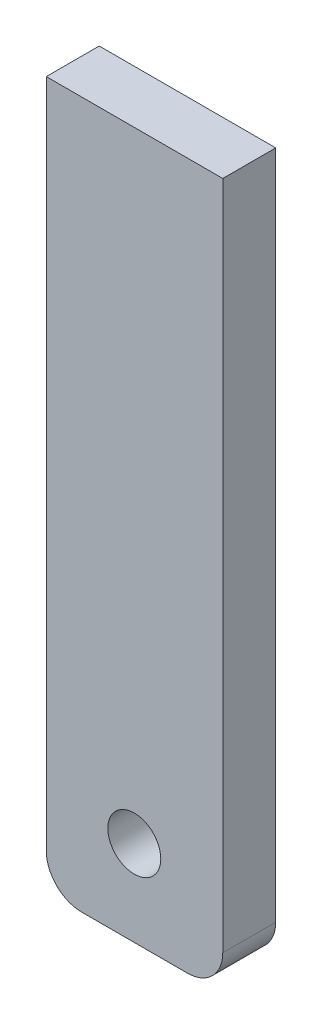
ISO-10303-21;
HEADER;
FILE_DESCRIPTION(('STEP AP214'),'2;1');
FILE_NAME('part.step','',(''),(''),'','','');
FILE_SCHEMA(('AUTOMOTIVE_DESIGN { 1 0 10303 214 1 1 1 1 }'));
ENDSEC;
DATA;
#1=APPLICATION_CONTEXT('core data for automotive mechanical design processes');
#2=APPLICATION_PROTOCOL_DEFINITION('international standard','automotive_design',2000,#1);
#3=PRODUCT_CONTEXT('',#1,'mechanical');
#4=PRODUCT('Part','Part','',(#3));
#5=PRODUCT_RELATED_PRODUCT_CATEGORY('part','',(#4));
#6=PRODUCT_DEFINITION_FORMATION('','',#4);
#7=PRODUCT_DEFINITION_CONTEXT('part definition',#1,'design');
#8=PRODUCT_DEFINITION('design','',#6,#7);
#9=PRODUCT_DEFINITION_SHAPE('','',#8);
#10=(LENGTH_UNIT() NAMED_UNIT(*) SI_UNIT(.MILLI.,.METRE.));
#11=(NAMED_UNIT(*) PLANE_ANGLE_UNIT() SI_UNIT($,.RADIAN.));
#12=(NAMED_UNIT(*) SI_UNIT($,.STERADIAN.) SOLID_ANGLE_UNIT());
#13=UNCERTAINTY_MEASURE_WITH_UNIT(LENGTH_MEASURE(1.E-05),#10,'distance_accuracy_value','');
#14=(GEOMETRIC_REPRESENTATION_CONTEXT(3) GLOBAL_UNCERTAINTY_ASSIGNED_CONTEXT((#13)) GLOBAL_UNIT_ASSIGNED_CONTEXT((#10,
#11,#12)) REPRESENTATION_CONTEXT('',''));
#15=CARTESIAN_POINT('',(0.,0.,0.));
#16=DIRECTION('',(0.,0.,1.));
#17=DIRECTION('',(1.,0.,0.));
#18=AXIS2_PLACEMENT_3D('',#15,#16,#17);
#19=CARTESIAN_POINT('',(67.2248383590829,-36.2584206165761,3.));
#20=DIRECTION('',(0.,0.,-1.));
#21=DIRECTION('',(-1.,0.,0.));
#22=AXIS2_PLACEMENT_3D('',#19,#20,#21);
#23=PLANE('',#22);
#24=CARTESIAN_POINT('',(67.2248383590829,-36.2584206165761,3.));
#25=DIRECTION('',(0.,0.,1.));
#26=DIRECTION('',(-1.,0.,0.));
#27=AXIS2_PLACEMENT_3D('',#24,#25,#26);
#28=CIRCLE('',#27,2.);
#29=CARTESIAN_POINT('',(65.2248383590829,-36.2584206165761,3.));
#30=VERTEX_POINT('',#29);
#31=CARTESIAN_POINT('',(67.224838359083,-38.2584206165761,3.));
#32=VERTEX_POINT('',#31);
#33=EDGE_CURVE('E139',#30,#32,#28,.T.);
#34=ORIENTED_EDGE('',*,*,#33,.T.);
#35=DIRECTION('',(1.,0.,0.));
#36=VECTOR('',#35,1.);
#37=CARTESIAN_POINT('',(73.2248383590829,-38.2584206165761,3.));
#38=LINE('',#37,#36);
#39=CARTESIAN_POINT('',(73.2248383590829,-38.2584206165761,3.));
#40=VERTEX_POINT('',#39);
#41=EDGE_CURVE('E97',#32,#40,#38,.T.);
#42=ORIENTED_EDGE('',*,*,#41,.T.);
#43=CARTESIAN_POINT('',(73.2248383590829,-36.2584206165761,3.));
#44=DIRECTION('',(0.,0.,1.));
#45=DIRECTION('',(-1.,0.,0.));
#46=AXIS2_PLACEMENT_3D('',#43,#44,#45);
#47=CIRCLE('',#46,2.);
#48=CARTESIAN_POINT('',(75.2248383590829,-36.2584206165761,3.));
#49=VERTEX_POINT('',#48);
#50=EDGE_CURVE('E110',#40,#49,#47,.T.);
#51=ORIENTED_EDGE('',*,*,#50,.T.);
#52=DIRECTION('',(0.,1.,0.));
#53=VECTOR('',#52,1.);
#54=CARTESIAN_POINT('',(75.2248383590829,1.74157938342393,3.));
#55=LINE('',#54,#53);
#56=CARTESIAN_POINT('',(75.2248383590829,1.74157938342393,3.));
#57=VERTEX_POINT('',#56);
#58=EDGE_CURVE('E104',#49,#57,#55,.T.);
#59=ORIENTED_EDGE('',*,*,#58,.T.);
#60=DIRECTION('',(-1.,0.,0.));
#61=VECTOR('',#60,1.);
#62=CARTESIAN_POINT('',(75.2248383590829,1.74157938342393,3.));
#63=LINE('',#62,#61);
#64=CARTESIAN_POINT('',(65.2248383590829,1.74157938342392,3.));
#65=VERTEX_POINT('',#64);
#66=EDGE_CURVE('E108',#57,#65,#63,.T.);
#67=ORIENTED_EDGE('',*,*,#66,.T.);
#68=DIRECTION('',(0.,-1.,0.));
#69=VECTOR('',#68,1.);
#70=CARTESIAN_POINT('',(65.2248383590829,-36.2584206165761,3.));
#71=LINE('',#70,#69);
#72=EDGE_CURVE('E60',#65,#30,#71,.T.);
#73=ORIENTED_EDGE('',*,*,#72,.T.);
#74=EDGE_LOOP('',(#34,#42,#51,#59,#67,#73));
#75=FACE_BOUND('',#74,.T.);
#76=CARTESIAN_POINT('',(70.2119028048271,-33.4050048492462,3.));
#77=DIRECTION('',(0.,0.,1.));
#78=DIRECTION('',(1.,0.,0.));
#79=AXIS2_PLACEMENT_3D('',#76,#77,#78);
#80=CIRCLE('',#79,1.5);
#81=CARTESIAN_POINT('',(71.7119028048271,-33.4050048492462,3.));
#82=VERTEX_POINT('',#81);
#83=EDGE_CURVE('E132',#82,#82,#80,.T.);
#84=ORIENTED_EDGE('',*,*,#83,.F.);
#85=EDGE_LOOP('',(#84));
#86=FACE_BOUND('',#85,.T.);
#87=ADVANCED_FACE('F43',(#75,#86),#23,.F.);
#88=CARTESIAN_POINT('',(67.2248383590829,-36.2584206165761,0.));
#89=DIRECTION('',(0.,0.,-1.));
#90=DIRECTION('',(-1.,0.,0.));
#91=AXIS2_PLACEMENT_3D('',#88,#89,#90);
#92=PLANE('',#91);
#93=CARTESIAN_POINT('',(67.2248383590829,-36.2584206165761,0.));
#94=DIRECTION('',(0.,0.,1.));
#95=DIRECTION('',(-1.,0.,0.));
#96=AXIS2_PLACEMENT_3D('',#93,#94,#95);
#97=CIRCLE('',#96,2.);
#98=CARTESIAN_POINT('',(65.2248383590829,-36.2584206165761,0.));
#99=VERTEX_POINT('',#98);
#100=CARTESIAN_POINT('',(67.224838359083,-38.2584206165761,0.));
#101=VERTEX_POINT('',#100);
#102=EDGE_CURVE('E128',#99,#101,#97,.T.);
#103=ORIENTED_EDGE('',*,*,#102,.F.);
#104=DIRECTION('',(0.,-1.,0.));
#105=VECTOR('',#104,1.);
#106=CARTESIAN_POINT('',(65.2248383590829,-36.2584206165761,0.));
#107=LINE('',#106,#105);
#108=CARTESIAN_POINT('',(65.2248383590829,1.74157938342392,0.));
#109=VERTEX_POINT('',#108);
#110=EDGE_CURVE('E89',#109,#99,#107,.T.);
#111=ORIENTED_EDGE('',*,*,#110,.F.);
#112=DIRECTION('',(-1.,0.,0.));
#113=VECTOR('',#112,1.);
#114=CARTESIAN_POINT('',(75.2248383590829,1.74157938342393,0.));
#115=LINE('',#114,#113);
#116=CARTESIAN_POINT('',(75.2248383590829,1.74157938342393,0.));
#117=VERTEX_POINT('',#116);
#118=EDGE_CURVE('E83',#117,#109,#115,.T.);
#119=ORIENTED_EDGE('',*,*,#118,.F.);
#120=DIRECTION('',(0.,1.,0.));
#121=VECTOR('',#120,1.);
#122=CARTESIAN_POINT('',(75.2248383590829,1.74157938342393,0.));
#123=LINE('',#122,#121);
#124=CARTESIAN_POINT('',(75.2248383590829,-36.2584206165761,0.));
#125=VERTEX_POINT('',#124);
#126=EDGE_CURVE('E118',#125,#117,#123,.T.);
#127=ORIENTED_EDGE('',*,*,#126,.F.);
#128=CARTESIAN_POINT('',(73.2248383590829,-36.2584206165761,0.));
#129=DIRECTION('',(0.,0.,1.));
#130=DIRECTION('',(-1.,0.,0.));
#131=AXIS2_PLACEMENT_3D('',#128,#129,#130);
#132=CIRCLE('',#131,2.);
#133=CARTESIAN_POINT('',(73.2248383590829,-38.2584206165761,0.));
#134=VERTEX_POINT('',#133);
#135=EDGE_CURVE('E134',#134,#125,#132,.T.);
#136=ORIENTED_EDGE('',*,*,#135,.F.);
#137=DIRECTION('',(1.,0.,0.));
#138=VECTOR('',#137,1.);
#139=CARTESIAN_POINT('',(73.2248383590829,-38.2584206165761,0.));
#140=LINE('',#139,#138);
#141=EDGE_CURVE('E131',#101,#134,#140,.T.);
#142=ORIENTED_EDGE('',*,*,#141,.F.);
#143=EDGE_LOOP('',(#103,#111,#119,#127,#136,#142));
#144=FACE_BOUND('',#143,.T.);
#145=CARTESIAN_POINT('',(70.2119028048271,-33.4050048492462,0.));
#146=DIRECTION('',(0.,0.,1.));
#147=DIRECTION('',(1.,0.,0.));
#148=AXIS2_PLACEMENT_3D('',#145,#146,#147);
#149=CIRCLE('',#148,1.5);
#150=CARTESIAN_POINT('',(71.7119028048271,-33.4050048492462,0.));
#151=VERTEX_POINT('',#150);
#152=EDGE_CURVE('E240',#151,#151,#149,.T.);
#153=ORIENTED_EDGE('',*,*,#152,.T.);
#154=EDGE_LOOP('',(#153));
#155=FACE_BOUND('',#154,.T.);
#156=ADVANCED_FACE('F148',(#144,#155),#92,.T.);
#157=CARTESIAN_POINT('',(67.2248383590829,-36.2584206165761,3.));
#158=DIRECTION('',(0.,0.,-1.));
#159=DIRECTION('',(-1.,0.,0.));
#160=AXIS2_PLACEMENT_3D('',#157,#158,#159);
#161=CYLINDRICAL_SURFACE('',#160,2.);
#162=ORIENTED_EDGE('',*,*,#102,.T.);
#163=DIRECTION('',(0.,0.,-1.));
#164=VECTOR('',#163,1.);
#165=CARTESIAN_POINT('',(67.224838359083,-38.2584206165761,3.));
#166=LINE('',#165,#164);
#167=EDGE_CURVE('E12',#32,#101,#166,.T.);
#168=ORIENTED_EDGE('',*,*,#167,.F.);
#169=ORIENTED_EDGE('',*,*,#33,.F.);
#170=DIRECTION('',(0.,0.,-1.));
#171=VECTOR('',#170,1.);
#172=CARTESIAN_POINT('',(65.2248383590829,-36.2584206165761,3.));
#173=LINE('',#172,#171);
#174=EDGE_CURVE('E124',#30,#99,#173,.T.);
#175=ORIENTED_EDGE('',*,*,#174,.T.);
#176=EDGE_LOOP('',(#162,#168,#169,#175));
#177=FACE_BOUND('',#176,.T.);
#178=ADVANCED_FACE('F45',(#177),#161,.T.);
#179=CARTESIAN_POINT('',(73.2248383590829,-38.2584206165761,3.));
#180=DIRECTION('',(0.,1.,0.));
#181=DIRECTION('',(0.,0.,1.));
#182=AXIS2_PLACEMENT_3D('',#179,#180,#181);
#183=PLANE('',#182);
#184=ORIENTED_EDGE('',*,*,#141,.T.);
#185=DIRECTION('',(0.,0.,-1.));
#186=VECTOR('',#185,1.);
#187=CARTESIAN_POINT('',(73.2248383590829,-38.2584206165761,3.));
#188=LINE('',#187,#186);
#189=EDGE_CURVE('E52',#40,#134,#188,.T.);
#190=ORIENTED_EDGE('',*,*,#189,.F.);
#191=ORIENTED_EDGE('',*,*,#41,.F.);
#192=ORIENTED_EDGE('',*,*,#167,.T.);
#193=EDGE_LOOP('',(#184,#190,#191,#192));
#194=FACE_BOUND('',#193,.T.);
#195=ADVANCED_FACE('F173',(#194),#183,.F.);
#196=CARTESIAN_POINT('',(73.2248383590829,-36.2584206165761,3.));
#197=DIRECTION('',(0.,0.,-1.));
#198=DIRECTION('',(-1.,0.,0.));
#199=AXIS2_PLACEMENT_3D('',#196,#197,#198);
#200=CYLINDRICAL_SURFACE('',#199,2.);
#201=ORIENTED_EDGE('',*,*,#135,.T.);
#202=DIRECTION('',(0.,0.,-1.));
#203=VECTOR('',#202,1.);
#204=CARTESIAN_POINT('',(75.2248383590829,-36.2584206165761,3.));
#205=LINE('',#204,#203);
#206=EDGE_CURVE('E119',#49,#125,#205,.T.);
#207=ORIENTED_EDGE('',*,*,#206,.F.);
#208=ORIENTED_EDGE('',*,*,#50,.F.);
#209=ORIENTED_EDGE('',*,*,#189,.T.);
#210=EDGE_LOOP('',(#201,#207,#208,#209));
#211=FACE_BOUND('',#210,.T.);
#212=ADVANCED_FACE('F145',(#211),#200,.T.);
#213=CARTESIAN_POINT('',(75.2248383590829,1.74157938342393,3.));
#214=DIRECTION('',(-1.,0.,0.));
#215=DIRECTION('',(0.,0.,1.));
#216=AXIS2_PLACEMENT_3D('',#213,#214,#215);
#217=PLANE('',#216);
#218=ORIENTED_EDGE('',*,*,#126,.T.);
#219=DIRECTION('',(0.,0.,-1.));
#220=VECTOR('',#219,1.);
#221=CARTESIAN_POINT('',(75.2248383590829,1.74157938342393,3.));
#222=LINE('',#221,#220);
#223=EDGE_CURVE('E115',#57,#117,#222,.T.);
#224=ORIENTED_EDGE('',*,*,#223,.F.);
#225=ORIENTED_EDGE('',*,*,#58,.F.);
#226=ORIENTED_EDGE('',*,*,#206,.T.);
#227=EDGE_LOOP('',(#218,#224,#225,#226));
#228=FACE_BOUND('',#227,.T.);
#229=ADVANCED_FACE('F116',(#228),#217,.F.);
#230=CARTESIAN_POINT('',(75.2248383590829,1.74157938342393,3.));
#231=DIRECTION('',(0.,-1.,0.));
#232=DIRECTION('',(1.,0.,0.));
#233=AXIS2_PLACEMENT_3D('',#230,#231,#232);
#234=PLANE('',#233);
#235=ORIENTED_EDGE('',*,*,#118,.T.);
#236=DIRECTION('',(0.,0.,-1.));
#237=VECTOR('',#236,1.);
#238=CARTESIAN_POINT('',(65.2248383590829,1.74157938342392,3.));
#239=LINE('',#238,#237);
#240=EDGE_CURVE('E120',#65,#109,#239,.T.);
#241=ORIENTED_EDGE('',*,*,#240,.F.);
#242=ORIENTED_EDGE('',*,*,#66,.F.);
#243=ORIENTED_EDGE('',*,*,#223,.T.);
#244=EDGE_LOOP('',(#235,#241,#242,#243));
#245=FACE_BOUND('',#244,.T.);
#246=ADVANCED_FACE('F122',(#245),#234,.F.);
#247=CARTESIAN_POINT('',(65.2248383590829,-36.2584206165761,3.));
#248=DIRECTION('',(1.,0.,0.));
#249=DIRECTION('',(0.,0.,-1.));
#250=AXIS2_PLACEMENT_3D('',#247,#248,#249);
#251=PLANE('',#250);
#252=ORIENTED_EDGE('',*,*,#110,.T.);
#253=ORIENTED_EDGE('',*,*,#174,.F.);
#254=ORIENTED_EDGE('',*,*,#72,.F.);
#255=ORIENTED_EDGE('',*,*,#240,.T.);
#256=EDGE_LOOP('',(#252,#253,#254,#255));
#257=FACE_BOUND('',#256,.T.);
#258=ADVANCED_FACE('F153',(#257),#251,.F.);
#259=CARTESIAN_POINT('',(70.2119028048271,-33.4050048492462,3.));
#260=DIRECTION('',(0.,0.,-1.));
#261=DIRECTION('',(-1.,0.,0.));
#262=AXIS2_PLACEMENT_3D('',#259,#260,#261);
#263=CYLINDRICAL_SURFACE('',#262,1.5);
#264=ORIENTED_EDGE('',*,*,#83,.T.);
#265=EDGE_LOOP('',(#264));
#266=FACE_BOUND('',#265,.T.);
#267=ORIENTED_EDGE('',*,*,#152,.F.);
#268=EDGE_LOOP('',(#267));
#269=FACE_BOUND('',#268,.T.);
#270=ADVANCED_FACE('F155',(#266,#269),#263,.F.);
#271=CLOSED_SHELL('',(#87,#156,#178,#195,#212,#229,#246,#258,#270));
#272=MANIFOLD_SOLID_BREP('B2',#271);
#273=ADVANCED_BREP_SHAPE_REPRESENTATION('',(#18,#272),#14);
#274=SHAPE_DEFINITION_REPRESENTATION(#9,#273);
ENDSEC;
END-ISO-10303-21;
